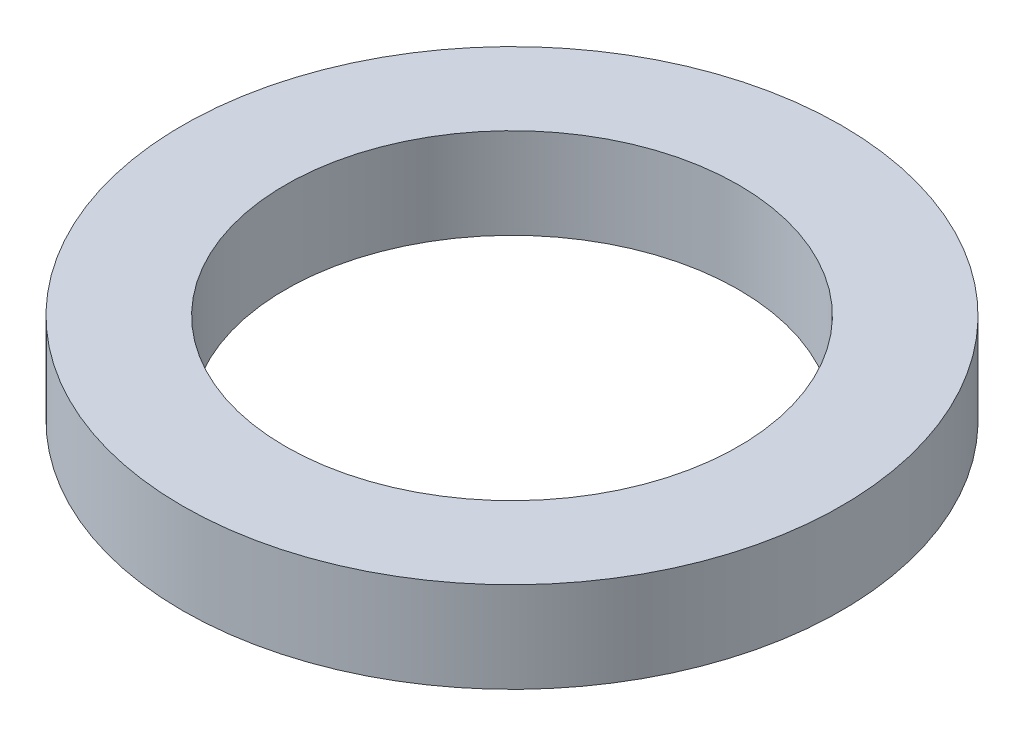
ISO-10303-21;
HEADER;
FILE_DESCRIPTION(('STEP AP214'),'2;1');
FILE_NAME('part.step','',(''),(''),'','','');
FILE_SCHEMA(('AUTOMOTIVE_DESIGN { 1 0 10303 214 1 1 1 1 }'));
ENDSEC;
DATA;
#1=APPLICATION_CONTEXT('core data for automotive mechanical design processes');
#2=APPLICATION_PROTOCOL_DEFINITION('international standard','automotive_design',2000,#1);
#3=PRODUCT_CONTEXT('',#1,'mechanical');
#4=PRODUCT('Part','Part','',(#3));
#5=PRODUCT_RELATED_PRODUCT_CATEGORY('part','',(#4));
#6=PRODUCT_DEFINITION_FORMATION('','',#4);
#7=PRODUCT_DEFINITION_CONTEXT('part definition',#1,'design');
#8=PRODUCT_DEFINITION('design','',#6,#7);
#9=PRODUCT_DEFINITION_SHAPE('','',#8);
#10=(LENGTH_UNIT() NAMED_UNIT(*) SI_UNIT(.MILLI.,.METRE.));
#11=(NAMED_UNIT(*) PLANE_ANGLE_UNIT() SI_UNIT($,.RADIAN.));
#12=(NAMED_UNIT(*) SI_UNIT($,.STERADIAN.) SOLID_ANGLE_UNIT());
#13=UNCERTAINTY_MEASURE_WITH_UNIT(LENGTH_MEASURE(1.E-05),#10,'distance_accuracy_value','');
#14=(GEOMETRIC_REPRESENTATION_CONTEXT(3) GLOBAL_UNCERTAINTY_ASSIGNED_CONTEXT((#13)) GLOBAL_UNIT_ASSIGNED_CONTEXT((#10,
#11,#12)) REPRESENTATION_CONTEXT('',''));
#15=CARTESIAN_POINT('',(0.,0.,0.));
#16=DIRECTION('',(0.,0.,1.));
#17=DIRECTION('',(1.,0.,0.));
#18=AXIS2_PLACEMENT_3D('',#15,#16,#17);
#19=CARTESIAN_POINT('',(0.,11.,0.));
#20=DIRECTION('',(0.,-1.,0.));
#21=DIRECTION('',(0.,0.,-1.));
#22=AXIS2_PLACEMENT_3D('',#19,#20,#21);
#23=CYLINDRICAL_SURFACE('',#22,40.);
#24=CARTESIAN_POINT('',(0.,11.,0.));
#25=DIRECTION('',(0.,1.,0.));
#26=DIRECTION('',(0.,0.,1.));
#27=AXIS2_PLACEMENT_3D('',#24,#25,#26);
#28=CIRCLE('',#27,40.);
#29=CARTESIAN_POINT('',(0.,11.,40.));
#30=VERTEX_POINT('',#29);
#31=EDGE_CURVE('E10',#30,#30,#28,.T.);
#32=ORIENTED_EDGE('',*,*,#31,.F.);
#33=EDGE_LOOP('',(#32));
#34=FACE_BOUND('',#33,.T.);
#35=CARTESIAN_POINT('',(0.,0.,0.));
#36=DIRECTION('',(0.,1.,0.));
#37=DIRECTION('',(0.,0.,1.));
#38=AXIS2_PLACEMENT_3D('',#35,#36,#37);
#39=CIRCLE('',#38,40.);
#40=CARTESIAN_POINT('',(0.,0.,40.));
#41=VERTEX_POINT('',#40);
#42=EDGE_CURVE('E37',#41,#41,#39,.T.);
#43=ORIENTED_EDGE('',*,*,#42,.T.);
#44=EDGE_LOOP('',(#43));
#45=FACE_BOUND('',#44,.T.);
#46=ADVANCED_FACE('F40',(#34,#45),#23,.T.);
#47=CARTESIAN_POINT('',(0.,11.,0.));
#48=DIRECTION('',(0.,1.,0.));
#49=DIRECTION('',(0.,0.,1.));
#50=AXIS2_PLACEMENT_3D('',#47,#48,#49);
#51=PLANE('',#50);
#52=CARTESIAN_POINT('',(0.,11.,0.));
#53=DIRECTION('',(0.,1.,0.));
#54=DIRECTION('',(0.,0.,1.));
#55=AXIS2_PLACEMENT_3D('',#52,#53,#54);
#56=CIRCLE('',#55,27.5);
#57=CARTESIAN_POINT('',(0.,11.,27.5));
#58=VERTEX_POINT('',#57);
#59=EDGE_CURVE('E50',#58,#58,#56,.T.);
#60=ORIENTED_EDGE('',*,*,#59,.F.);
#61=EDGE_LOOP('',(#60));
#62=FACE_BOUND('',#61,.T.);
#63=ORIENTED_EDGE('',*,*,#31,.T.);
#64=EDGE_LOOP('',(#63));
#65=FACE_BOUND('',#64,.T.);
#66=ADVANCED_FACE('F59',(#62,#65),#51,.T.);
#67=CARTESIAN_POINT('',(0.,0.,0.));
#68=DIRECTION('',(0.,1.,0.));
#69=DIRECTION('',(0.,0.,1.));
#70=AXIS2_PLACEMENT_3D('',#67,#68,#69);
#71=PLANE('',#70);
#72=CARTESIAN_POINT('',(0.,0.,0.));
#73=DIRECTION('',(0.,1.,0.));
#74=DIRECTION('',(0.,0.,1.));
#75=AXIS2_PLACEMENT_3D('',#72,#73,#74);
#76=CIRCLE('',#75,27.5);
#77=CARTESIAN_POINT('',(0.,0.,27.5));
#78=VERTEX_POINT('',#77);
#79=EDGE_CURVE('E47',#78,#78,#76,.T.);
#80=ORIENTED_EDGE('',*,*,#79,.T.);
#81=EDGE_LOOP('',(#80));
#82=FACE_BOUND('',#81,.T.);
#83=ORIENTED_EDGE('',*,*,#42,.F.);
#84=EDGE_LOOP('',(#83));
#85=FACE_BOUND('',#84,.T.);
#86=ADVANCED_FACE('F58',(#82,#85),#71,.F.);
#87=CARTESIAN_POINT('',(0.,11.,0.));
#88=DIRECTION('',(0.,-1.,0.));
#89=DIRECTION('',(0.,0.,-1.));
#90=AXIS2_PLACEMENT_3D('',#87,#88,#89);
#91=CYLINDRICAL_SURFACE('',#90,27.5);
#92=ORIENTED_EDGE('',*,*,#59,.T.);
#93=EDGE_LOOP('',(#92));
#94=FACE_BOUND('',#93,.T.);
#95=ORIENTED_EDGE('',*,*,#79,.F.);
#96=EDGE_LOOP('',(#95));
#97=FACE_BOUND('',#96,.T.);
#98=ADVANCED_FACE('F54',(#94,#97),#91,.F.);
#99=CLOSED_SHELL('',(#46,#66,#86,#98));
#100=MANIFOLD_SOLID_BREP('B2',#99);
#101=ADVANCED_BREP_SHAPE_REPRESENTATION('',(#18,#100),#14);
#102=SHAPE_DEFINITION_REPRESENTATION(#9,#101);
ENDSEC;
END-ISO-10303-21;
